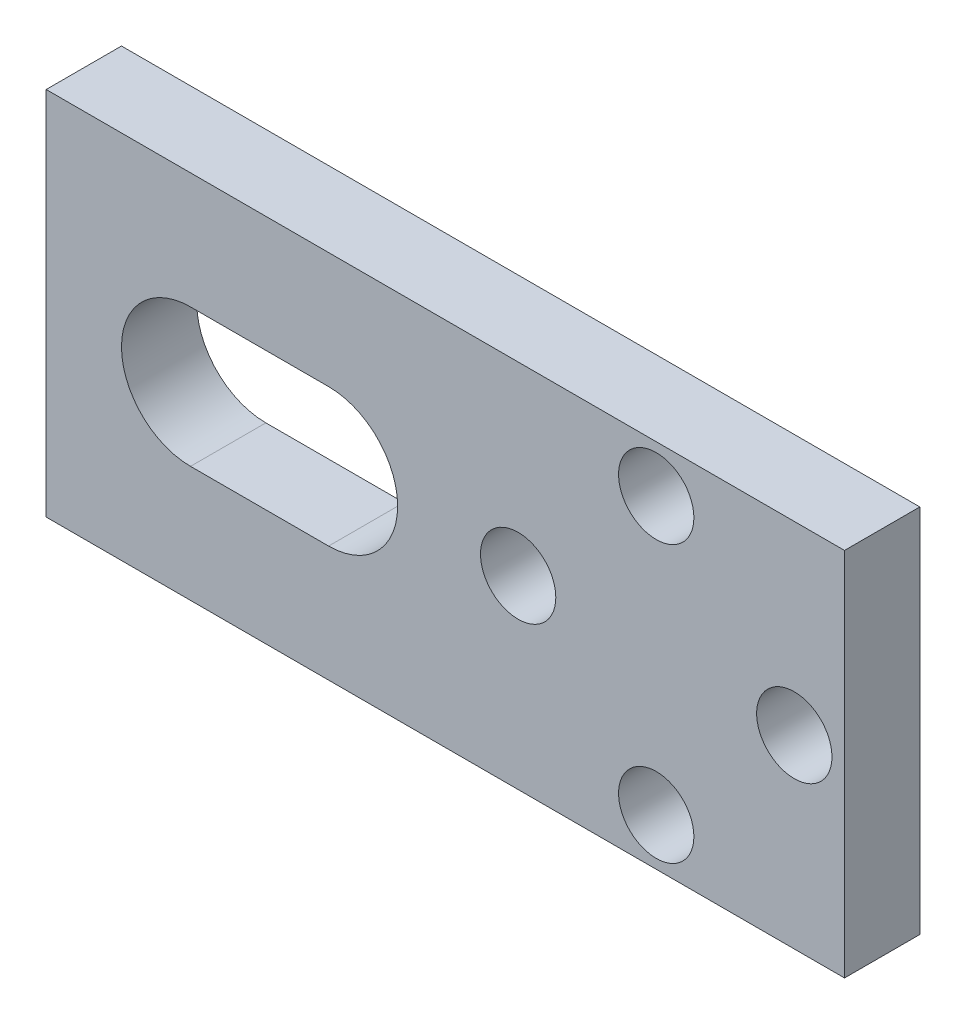
ISO-10303-21;
HEADER;
FILE_DESCRIPTION(('STEP AP214'),'2;1');
FILE_NAME('part.step','',(''),(''),'','','');
FILE_SCHEMA(('AUTOMOTIVE_DESIGN { 1 0 10303 214 1 1 1 1 }'));
ENDSEC;
DATA;
#1=APPLICATION_CONTEXT('core data for automotive mechanical design processes');
#2=APPLICATION_PROTOCOL_DEFINITION('international standard','automotive_design',2000,#1);
#3=PRODUCT_CONTEXT('',#1,'mechanical');
#4=PRODUCT('Part','Part','',(#3));
#5=PRODUCT_RELATED_PRODUCT_CATEGORY('part','',(#4));
#6=PRODUCT_DEFINITION_FORMATION('','',#4);
#7=PRODUCT_DEFINITION_CONTEXT('part definition',#1,'design');
#8=PRODUCT_DEFINITION('design','',#6,#7);
#9=PRODUCT_DEFINITION_SHAPE('','',#8);
#10=(LENGTH_UNIT() NAMED_UNIT(*) SI_UNIT(.MILLI.,.METRE.));
#11=(NAMED_UNIT(*) PLANE_ANGLE_UNIT() SI_UNIT($,.RADIAN.));
#12=(NAMED_UNIT(*) SI_UNIT($,.STERADIAN.) SOLID_ANGLE_UNIT());
#13=UNCERTAINTY_MEASURE_WITH_UNIT(LENGTH_MEASURE(1.E-05),#10,'distance_accuracy_value','');
#14=(GEOMETRIC_REPRESENTATION_CONTEXT(3) GLOBAL_UNCERTAINTY_ASSIGNED_CONTEXT((#13)) GLOBAL_UNIT_ASSIGNED_CONTEXT((#10,
#11,#12)) REPRESENTATION_CONTEXT('',''));
#15=CARTESIAN_POINT('',(0.,0.,0.));
#16=DIRECTION('',(0.,0.,1.));
#17=DIRECTION('',(1.,0.,0.));
#18=AXIS2_PLACEMENT_3D('',#15,#16,#17);
#19=CARTESIAN_POINT('',(0.,0.,3.));
#20=DIRECTION('',(0.,0.,-1.));
#21=DIRECTION('',(-1.,0.,0.));
#22=AXIS2_PLACEMENT_3D('',#19,#20,#21);
#23=PLANE('',#22);
#24=CARTESIAN_POINT('',(24.3,12.875,3.));
#25=DIRECTION('',(0.,0.,1.));
#26=DIRECTION('',(1.,0.,0.));
#27=AXIS2_PLACEMENT_3D('',#24,#25,#26);
#28=CIRCLE('',#27,1.5);
#29=CARTESIAN_POINT('',(25.8,12.875,3.));
#30=VERTEX_POINT('',#29);
#31=EDGE_CURVE('E245',#30,#30,#28,.T.);
#32=ORIENTED_EDGE('',*,*,#31,.F.);
#33=EDGE_LOOP('',(#32));
#34=FACE_BOUND('',#33,.T.);
#35=CARTESIAN_POINT('',(29.8,7.375,3.));
#36=DIRECTION('',(0.,0.,1.));
#37=DIRECTION('',(1.,0.,0.));
#38=AXIS2_PLACEMENT_3D('',#35,#36,#37);
#39=CIRCLE('',#38,1.5);
#40=CARTESIAN_POINT('',(31.3,7.375,3.));
#41=VERTEX_POINT('',#40);
#42=EDGE_CURVE('E126',#41,#41,#39,.T.);
#43=ORIENTED_EDGE('',*,*,#42,.F.);
#44=EDGE_LOOP('',(#43));
#45=FACE_BOUND('',#44,.T.);
#46=DIRECTION('',(0.,-1.,0.));
#47=VECTOR('',#46,1.);
#48=CARTESIAN_POINT('',(0.,0.,3.));
#49=LINE('',#48,#47);
#50=CARTESIAN_POINT('',(0.,14.75,3.));
#51=VERTEX_POINT('',#50);
#52=CARTESIAN_POINT('',(0.,0.,3.));
#53=VERTEX_POINT('',#52);
#54=EDGE_CURVE('E136',#51,#53,#49,.T.);
#55=ORIENTED_EDGE('',*,*,#54,.T.);
#56=DIRECTION('',(1.,0.,0.));
#57=VECTOR('',#56,1.);
#58=CARTESIAN_POINT('',(0.,0.,3.));
#59=LINE('',#58,#57);
#60=CARTESIAN_POINT('',(31.8,0.,3.));
#61=VERTEX_POINT('',#60);
#62=EDGE_CURVE('E139',#53,#61,#59,.T.);
#63=ORIENTED_EDGE('',*,*,#62,.T.);
#64=DIRECTION('',(0.,1.,0.));
#65=VECTOR('',#64,1.);
#66=CARTESIAN_POINT('',(31.8,0.,3.));
#67=LINE('',#66,#65);
#68=CARTESIAN_POINT('',(31.8,14.75,3.));
#69=VERTEX_POINT('',#68);
#70=EDGE_CURVE('E142',#61,#69,#67,.T.);
#71=ORIENTED_EDGE('',*,*,#70,.T.);
#72=DIRECTION('',(-1.,0.,0.));
#73=VECTOR('',#72,1.);
#74=CARTESIAN_POINT('',(0.,14.75,3.));
#75=LINE('',#74,#73);
#76=EDGE_CURVE('E144',#69,#51,#75,.T.);
#77=ORIENTED_EDGE('',*,*,#76,.T.);
#78=EDGE_LOOP('',(#55,#63,#71,#77));
#79=FACE_BOUND('',#78,.T.);
#80=CARTESIAN_POINT('',(5.75,7.375,3.));
#81=DIRECTION('',(0.,0.,1.));
#82=DIRECTION('',(1.,0.,0.));
#83=AXIS2_PLACEMENT_3D('',#80,#81,#82);
#84=CIRCLE('',#83,2.75);
#85=CARTESIAN_POINT('',(5.75,10.125,3.));
#86=VERTEX_POINT('',#85);
#87=CARTESIAN_POINT('',(5.75,4.625,3.));
#88=VERTEX_POINT('',#87);
#89=EDGE_CURVE('E97',#86,#88,#84,.T.);
#90=ORIENTED_EDGE('',*,*,#89,.F.);
#91=DIRECTION('',(-1.,0.,0.));
#92=VECTOR('',#91,1.);
#93=CARTESIAN_POINT('',(5.75,10.125,3.));
#94=LINE('',#93,#92);
#95=CARTESIAN_POINT('',(11.25,10.125,3.));
#96=VERTEX_POINT('',#95);
#97=EDGE_CURVE('E120',#96,#86,#94,.T.);
#98=ORIENTED_EDGE('',*,*,#97,.F.);
#99=CARTESIAN_POINT('',(11.25,7.375,3.));
#100=DIRECTION('',(0.,0.,1.));
#101=DIRECTION('',(1.,0.,0.));
#102=AXIS2_PLACEMENT_3D('',#99,#100,#101);
#103=CIRCLE('',#102,2.75);
#104=CARTESIAN_POINT('',(11.25,4.625,3.));
#105=VERTEX_POINT('',#104);
#106=EDGE_CURVE('E118',#105,#96,#103,.T.);
#107=ORIENTED_EDGE('',*,*,#106,.F.);
#108=DIRECTION('',(1.,0.,0.));
#109=VECTOR('',#108,1.);
#110=CARTESIAN_POINT('',(5.75,4.625,3.));
#111=LINE('',#110,#109);
#112=EDGE_CURVE('E105',#88,#105,#111,.T.);
#113=ORIENTED_EDGE('',*,*,#112,.F.);
#114=EDGE_LOOP('',(#90,#98,#107,#113));
#115=FACE_BOUND('',#114,.T.);
#116=CARTESIAN_POINT('',(18.8,7.375,3.));
#117=DIRECTION('',(0.,0.,1.));
#118=DIRECTION('',(1.,0.,0.));
#119=AXIS2_PLACEMENT_3D('',#116,#117,#118);
#120=CIRCLE('',#119,1.5);
#121=CARTESIAN_POINT('',(20.3,7.375,3.));
#122=VERTEX_POINT('',#121);
#123=EDGE_CURVE('E251',#122,#122,#120,.T.);
#124=ORIENTED_EDGE('',*,*,#123,.F.);
#125=EDGE_LOOP('',(#124));
#126=FACE_BOUND('',#125,.T.);
#127=CARTESIAN_POINT('',(24.3,1.875,3.));
#128=DIRECTION('',(0.,0.,1.));
#129=DIRECTION('',(1.,0.,0.));
#130=AXIS2_PLACEMENT_3D('',#127,#128,#129);
#131=CIRCLE('',#130,1.5);
#132=CARTESIAN_POINT('',(25.8,1.875,3.));
#133=VERTEX_POINT('',#132);
#134=EDGE_CURVE('E236',#133,#133,#131,.T.);
#135=ORIENTED_EDGE('',*,*,#134,.F.);
#136=EDGE_LOOP('',(#135));
#137=FACE_BOUND('',#136,.T.);
#138=ADVANCED_FACE('F32',(#34,#45,#79,#115,#126,#137),#23,.F.);
#139=CARTESIAN_POINT('',(0.,0.,0.));
#140=DIRECTION('',(0.,0.,-1.));
#141=DIRECTION('',(-1.,0.,0.));
#142=AXIS2_PLACEMENT_3D('',#139,#140,#141);
#143=PLANE('',#142);
#144=CARTESIAN_POINT('',(24.3,12.875,0.));
#145=DIRECTION('',(0.,0.,1.));
#146=DIRECTION('',(1.,0.,0.));
#147=AXIS2_PLACEMENT_3D('',#144,#145,#146);
#148=CIRCLE('',#147,1.5);
#149=CARTESIAN_POINT('',(25.8,12.875,0.));
#150=VERTEX_POINT('',#149);
#151=EDGE_CURVE('E242',#150,#150,#148,.T.);
#152=ORIENTED_EDGE('',*,*,#151,.T.);
#153=EDGE_LOOP('',(#152));
#154=FACE_BOUND('',#153,.T.);
#155=CARTESIAN_POINT('',(29.8,7.375,0.));
#156=DIRECTION('',(0.,0.,1.));
#157=DIRECTION('',(1.,0.,0.));
#158=AXIS2_PLACEMENT_3D('',#155,#156,#157);
#159=CIRCLE('',#158,1.5);
#160=CARTESIAN_POINT('',(31.3,7.375,0.));
#161=VERTEX_POINT('',#160);
#162=EDGE_CURVE('E254',#161,#161,#159,.T.);
#163=ORIENTED_EDGE('',*,*,#162,.T.);
#164=EDGE_LOOP('',(#163));
#165=FACE_BOUND('',#164,.T.);
#166=DIRECTION('',(0.,-1.,0.));
#167=VECTOR('',#166,1.);
#168=CARTESIAN_POINT('',(0.,0.,0.));
#169=LINE('',#168,#167);
#170=CARTESIAN_POINT('',(0.,14.75,0.));
#171=VERTEX_POINT('',#170);
#172=CARTESIAN_POINT('',(0.,0.,0.));
#173=VERTEX_POINT('',#172);
#174=EDGE_CURVE('E113',#171,#173,#169,.T.);
#175=ORIENTED_EDGE('',*,*,#174,.F.);
#176=DIRECTION('',(-1.,0.,0.));
#177=VECTOR('',#176,1.);
#178=CARTESIAN_POINT('',(0.,14.75,0.));
#179=LINE('',#178,#177);
#180=CARTESIAN_POINT('',(31.8,14.75,0.));
#181=VERTEX_POINT('',#180);
#182=EDGE_CURVE('E140',#181,#171,#179,.T.);
#183=ORIENTED_EDGE('',*,*,#182,.F.);
#184=DIRECTION('',(0.,1.,0.));
#185=VECTOR('',#184,1.);
#186=CARTESIAN_POINT('',(31.8,0.,0.));
#187=LINE('',#186,#185);
#188=CARTESIAN_POINT('',(31.8,0.,0.));
#189=VERTEX_POINT('',#188);
#190=EDGE_CURVE('E151',#189,#181,#187,.T.);
#191=ORIENTED_EDGE('',*,*,#190,.F.);
#192=DIRECTION('',(1.,0.,0.));
#193=VECTOR('',#192,1.);
#194=CARTESIAN_POINT('',(0.,0.,0.));
#195=LINE('',#194,#193);
#196=EDGE_CURVE('E149',#173,#189,#195,.T.);
#197=ORIENTED_EDGE('',*,*,#196,.F.);
#198=EDGE_LOOP('',(#175,#183,#191,#197));
#199=FACE_BOUND('',#198,.T.);
#200=DIRECTION('',(-1.,0.,0.));
#201=VECTOR('',#200,1.);
#202=CARTESIAN_POINT('',(5.75,10.125,0.));
#203=LINE('',#202,#201);
#204=CARTESIAN_POINT('',(11.25,10.125,0.));
#205=VERTEX_POINT('',#204);
#206=CARTESIAN_POINT('',(5.75,10.125,0.));
#207=VERTEX_POINT('',#206);
#208=EDGE_CURVE('E106',#205,#207,#203,.T.);
#209=ORIENTED_EDGE('',*,*,#208,.T.);
#210=CARTESIAN_POINT('',(5.75,7.375,0.));
#211=DIRECTION('',(0.,0.,1.));
#212=DIRECTION('',(1.,0.,0.));
#213=AXIS2_PLACEMENT_3D('',#210,#211,#212);
#214=CIRCLE('',#213,2.75);
#215=CARTESIAN_POINT('',(5.75,4.625,0.));
#216=VERTEX_POINT('',#215);
#217=EDGE_CURVE('E55',#207,#216,#214,.T.);
#218=ORIENTED_EDGE('',*,*,#217,.T.);
#219=DIRECTION('',(1.,0.,0.));
#220=VECTOR('',#219,1.);
#221=CARTESIAN_POINT('',(5.75,4.625,0.));
#222=LINE('',#221,#220);
#223=CARTESIAN_POINT('',(11.25,4.625,0.));
#224=VERTEX_POINT('',#223);
#225=EDGE_CURVE('E112',#216,#224,#222,.T.);
#226=ORIENTED_EDGE('',*,*,#225,.T.);
#227=CARTESIAN_POINT('',(11.25,7.375,0.));
#228=DIRECTION('',(0.,0.,1.));
#229=DIRECTION('',(1.,0.,0.));
#230=AXIS2_PLACEMENT_3D('',#227,#228,#229);
#231=CIRCLE('',#230,2.75);
#232=EDGE_CURVE('E128',#224,#205,#231,.T.);
#233=ORIENTED_EDGE('',*,*,#232,.T.);
#234=EDGE_LOOP('',(#209,#218,#226,#233));
#235=FACE_BOUND('',#234,.T.);
#236=CARTESIAN_POINT('',(18.8,7.375,0.));
#237=DIRECTION('',(0.,0.,1.));
#238=DIRECTION('',(1.,0.,0.));
#239=AXIS2_PLACEMENT_3D('',#236,#237,#238);
#240=CIRCLE('',#239,1.5);
#241=CARTESIAN_POINT('',(20.3,7.375,0.));
#242=VERTEX_POINT('',#241);
#243=EDGE_CURVE('E248',#242,#242,#240,.T.);
#244=ORIENTED_EDGE('',*,*,#243,.T.);
#245=EDGE_LOOP('',(#244));
#246=FACE_BOUND('',#245,.T.);
#247=CARTESIAN_POINT('',(24.3,1.875,0.));
#248=DIRECTION('',(0.,0.,1.));
#249=DIRECTION('',(1.,0.,0.));
#250=AXIS2_PLACEMENT_3D('',#247,#248,#249);
#251=CIRCLE('',#250,1.5);
#252=CARTESIAN_POINT('',(25.8,1.875,0.));
#253=VERTEX_POINT('',#252);
#254=EDGE_CURVE('E239',#253,#253,#251,.T.);
#255=ORIENTED_EDGE('',*,*,#254,.T.);
#256=EDGE_LOOP('',(#255));
#257=FACE_BOUND('',#256,.T.);
#258=ADVANCED_FACE('F169',(#154,#165,#199,#235,#246,#257),#143,.T.);
#259=CARTESIAN_POINT('',(0.,0.,3.));
#260=DIRECTION('',(1.,0.,0.));
#261=DIRECTION('',(0.,0.,-1.));
#262=AXIS2_PLACEMENT_3D('',#259,#260,#261);
#263=PLANE('',#262);
#264=ORIENTED_EDGE('',*,*,#174,.T.);
#265=DIRECTION('',(0.,0.,-1.));
#266=VECTOR('',#265,1.);
#267=CARTESIAN_POINT('',(0.,0.,3.));
#268=LINE('',#267,#266);
#269=EDGE_CURVE('E11',#53,#173,#268,.T.);
#270=ORIENTED_EDGE('',*,*,#269,.F.);
#271=ORIENTED_EDGE('',*,*,#54,.F.);
#272=DIRECTION('',(0.,0.,-1.));
#273=VECTOR('',#272,1.);
#274=CARTESIAN_POINT('',(0.,14.75,3.));
#275=LINE('',#274,#273);
#276=EDGE_CURVE('E146',#51,#171,#275,.T.);
#277=ORIENTED_EDGE('',*,*,#276,.T.);
#278=EDGE_LOOP('',(#264,#270,#271,#277));
#279=FACE_BOUND('',#278,.T.);
#280=ADVANCED_FACE('F34',(#279),#263,.F.);
#281=CARTESIAN_POINT('',(0.,0.,3.));
#282=DIRECTION('',(0.,1.,0.));
#283=DIRECTION('',(0.,0.,1.));
#284=AXIS2_PLACEMENT_3D('',#281,#282,#283);
#285=PLANE('',#284);
#286=ORIENTED_EDGE('',*,*,#196,.T.);
#287=DIRECTION('',(0.,0.,-1.));
#288=VECTOR('',#287,1.);
#289=CARTESIAN_POINT('',(31.8,0.,3.));
#290=LINE('',#289,#288);
#291=EDGE_CURVE('E40',#61,#189,#290,.T.);
#292=ORIENTED_EDGE('',*,*,#291,.F.);
#293=ORIENTED_EDGE('',*,*,#62,.F.);
#294=ORIENTED_EDGE('',*,*,#269,.T.);
#295=EDGE_LOOP('',(#286,#292,#293,#294));
#296=FACE_BOUND('',#295,.T.);
#297=ADVANCED_FACE('F179',(#296),#285,.F.);
#298=CARTESIAN_POINT('',(31.8,0.,3.));
#299=DIRECTION('',(-1.,0.,0.));
#300=DIRECTION('',(0.,0.,1.));
#301=AXIS2_PLACEMENT_3D('',#298,#299,#300);
#302=PLANE('',#301);
#303=ORIENTED_EDGE('',*,*,#190,.T.);
#304=DIRECTION('',(0.,0.,-1.));
#305=VECTOR('',#304,1.);
#306=CARTESIAN_POINT('',(31.8,14.75,3.));
#307=LINE('',#306,#305);
#308=EDGE_CURVE('E156',#69,#181,#307,.T.);
#309=ORIENTED_EDGE('',*,*,#308,.F.);
#310=ORIENTED_EDGE('',*,*,#70,.F.);
#311=ORIENTED_EDGE('',*,*,#291,.T.);
#312=EDGE_LOOP('',(#303,#309,#310,#311));
#313=FACE_BOUND('',#312,.T.);
#314=ADVANCED_FACE('F163',(#313),#302,.F.);
#315=CARTESIAN_POINT('',(0.,14.75,3.));
#316=DIRECTION('',(0.,-1.,0.));
#317=DIRECTION('',(0.,0.,-1.));
#318=AXIS2_PLACEMENT_3D('',#315,#316,#317);
#319=PLANE('',#318);
#320=ORIENTED_EDGE('',*,*,#182,.T.);
#321=ORIENTED_EDGE('',*,*,#276,.F.);
#322=ORIENTED_EDGE('',*,*,#76,.F.);
#323=ORIENTED_EDGE('',*,*,#308,.T.);
#324=EDGE_LOOP('',(#320,#321,#322,#323));
#325=FACE_BOUND('',#324,.T.);
#326=ADVANCED_FACE('F173',(#325),#319,.F.);
#327=CARTESIAN_POINT('',(5.75,7.375,3.));
#328=DIRECTION('',(0.,0.,-1.));
#329=DIRECTION('',(-1.,0.,0.));
#330=AXIS2_PLACEMENT_3D('',#327,#328,#329);
#331=CYLINDRICAL_SURFACE('',#330,2.75);
#332=ORIENTED_EDGE('',*,*,#217,.F.);
#333=DIRECTION('',(0.,0.,-1.));
#334=VECTOR('',#333,1.);
#335=CARTESIAN_POINT('',(5.75,10.125,3.));
#336=LINE('',#335,#334);
#337=EDGE_CURVE('E101',#86,#207,#336,.T.);
#338=ORIENTED_EDGE('',*,*,#337,.F.);
#339=ORIENTED_EDGE('',*,*,#89,.T.);
#340=DIRECTION('',(0.,0.,-1.));
#341=VECTOR('',#340,1.);
#342=CARTESIAN_POINT('',(5.75,4.625,3.));
#343=LINE('',#342,#341);
#344=EDGE_CURVE('E100',#88,#216,#343,.T.);
#345=ORIENTED_EDGE('',*,*,#344,.T.);
#346=EDGE_LOOP('',(#332,#338,#339,#345));
#347=FACE_BOUND('',#346,.T.);
#348=ADVANCED_FACE('F99',(#347),#331,.F.);
#349=CARTESIAN_POINT('',(5.75,4.625,3.));
#350=DIRECTION('',(0.,1.,0.));
#351=DIRECTION('',(-1.,0.,0.));
#352=AXIS2_PLACEMENT_3D('',#349,#350,#351);
#353=PLANE('',#352);
#354=ORIENTED_EDGE('',*,*,#225,.F.);
#355=ORIENTED_EDGE('',*,*,#344,.F.);
#356=ORIENTED_EDGE('',*,*,#112,.T.);
#357=DIRECTION('',(0.,0.,-1.));
#358=VECTOR('',#357,1.);
#359=CARTESIAN_POINT('',(11.25,4.625,3.));
#360=LINE('',#359,#358);
#361=EDGE_CURVE('E114',#105,#224,#360,.T.);
#362=ORIENTED_EDGE('',*,*,#361,.T.);
#363=EDGE_LOOP('',(#354,#355,#356,#362));
#364=FACE_BOUND('',#363,.T.);
#365=ADVANCED_FACE('F109',(#364),#353,.T.);
#366=CARTESIAN_POINT('',(11.25,7.375,3.));
#367=DIRECTION('',(0.,0.,-1.));
#368=DIRECTION('',(-1.,0.,0.));
#369=AXIS2_PLACEMENT_3D('',#366,#367,#368);
#370=CYLINDRICAL_SURFACE('',#369,2.75);
#371=ORIENTED_EDGE('',*,*,#232,.F.);
#372=ORIENTED_EDGE('',*,*,#361,.F.);
#373=ORIENTED_EDGE('',*,*,#106,.T.);
#374=DIRECTION('',(0.,0.,-1.));
#375=VECTOR('',#374,1.);
#376=CARTESIAN_POINT('',(11.25,10.125,3.));
#377=LINE('',#376,#375);
#378=EDGE_CURVE('E47',#96,#205,#377,.T.);
#379=ORIENTED_EDGE('',*,*,#378,.T.);
#380=EDGE_LOOP('',(#371,#372,#373,#379));
#381=FACE_BOUND('',#380,.T.);
#382=ADVANCED_FACE('F206',(#381),#370,.F.);
#383=CARTESIAN_POINT('',(5.75,10.125,3.));
#384=DIRECTION('',(0.,-1.,0.));
#385=DIRECTION('',(0.,0.,-1.));
#386=AXIS2_PLACEMENT_3D('',#383,#384,#385);
#387=PLANE('',#386);
#388=ORIENTED_EDGE('',*,*,#208,.F.);
#389=ORIENTED_EDGE('',*,*,#378,.F.);
#390=ORIENTED_EDGE('',*,*,#97,.T.);
#391=ORIENTED_EDGE('',*,*,#337,.T.);
#392=EDGE_LOOP('',(#388,#389,#390,#391));
#393=FACE_BOUND('',#392,.T.);
#394=ADVANCED_FACE('F210',(#393),#387,.T.);
#395=CARTESIAN_POINT('',(29.8,7.375,3.));
#396=DIRECTION('',(0.,0.,-1.));
#397=DIRECTION('',(-1.,0.,0.));
#398=AXIS2_PLACEMENT_3D('',#395,#396,#397);
#399=CYLINDRICAL_SURFACE('',#398,1.5);
#400=ORIENTED_EDGE('',*,*,#42,.T.);
#401=EDGE_LOOP('',(#400));
#402=FACE_BOUND('',#401,.T.);
#403=ORIENTED_EDGE('',*,*,#162,.F.);
#404=EDGE_LOOP('',(#403));
#405=FACE_BOUND('',#404,.T.);
#406=ADVANCED_FACE('F216',(#402,#405),#399,.F.);
#407=CARTESIAN_POINT('',(18.8,7.375,3.));
#408=DIRECTION('',(0.,0.,-1.));
#409=DIRECTION('',(-1.,0.,0.));
#410=AXIS2_PLACEMENT_3D('',#407,#408,#409);
#411=CYLINDRICAL_SURFACE('',#410,1.5);
#412=ORIENTED_EDGE('',*,*,#123,.T.);
#413=EDGE_LOOP('',(#412));
#414=FACE_BOUND('',#413,.T.);
#415=ORIENTED_EDGE('',*,*,#243,.F.);
#416=EDGE_LOOP('',(#415));
#417=FACE_BOUND('',#416,.T.);
#418=ADVANCED_FACE('F219',(#414,#417),#411,.F.);
#419=CARTESIAN_POINT('',(24.3,12.875,3.));
#420=DIRECTION('',(0.,0.,-1.));
#421=DIRECTION('',(-1.,0.,0.));
#422=AXIS2_PLACEMENT_3D('',#419,#420,#421);
#423=CYLINDRICAL_SURFACE('',#422,1.5);
#424=ORIENTED_EDGE('',*,*,#31,.T.);
#425=EDGE_LOOP('',(#424));
#426=FACE_BOUND('',#425,.T.);
#427=ORIENTED_EDGE('',*,*,#151,.F.);
#428=EDGE_LOOP('',(#427));
#429=FACE_BOUND('',#428,.T.);
#430=ADVANCED_FACE('F223',(#426,#429),#423,.F.);
#431=CARTESIAN_POINT('',(24.3,1.875,3.));
#432=DIRECTION('',(0.,0.,-1.));
#433=DIRECTION('',(-1.,0.,0.));
#434=AXIS2_PLACEMENT_3D('',#431,#432,#433);
#435=CYLINDRICAL_SURFACE('',#434,1.5);
#436=ORIENTED_EDGE('',*,*,#134,.T.);
#437=EDGE_LOOP('',(#436));
#438=FACE_BOUND('',#437,.T.);
#439=ORIENTED_EDGE('',*,*,#254,.F.);
#440=EDGE_LOOP('',(#439));
#441=FACE_BOUND('',#440,.T.);
#442=ADVANCED_FACE('F227',(#438,#441),#435,.F.);
#443=CLOSED_SHELL('',(#138,#258,#280,#297,#314,#326,#348,#365,#382,#394,#406,#418,#430,#442));
#444=MANIFOLD_SOLID_BREP('B2',#443);
#445=ADVANCED_BREP_SHAPE_REPRESENTATION('',(#18,#444),#14);
#446=SHAPE_DEFINITION_REPRESENTATION(#9,#445);
ENDSEC;
END-ISO-10303-21;
